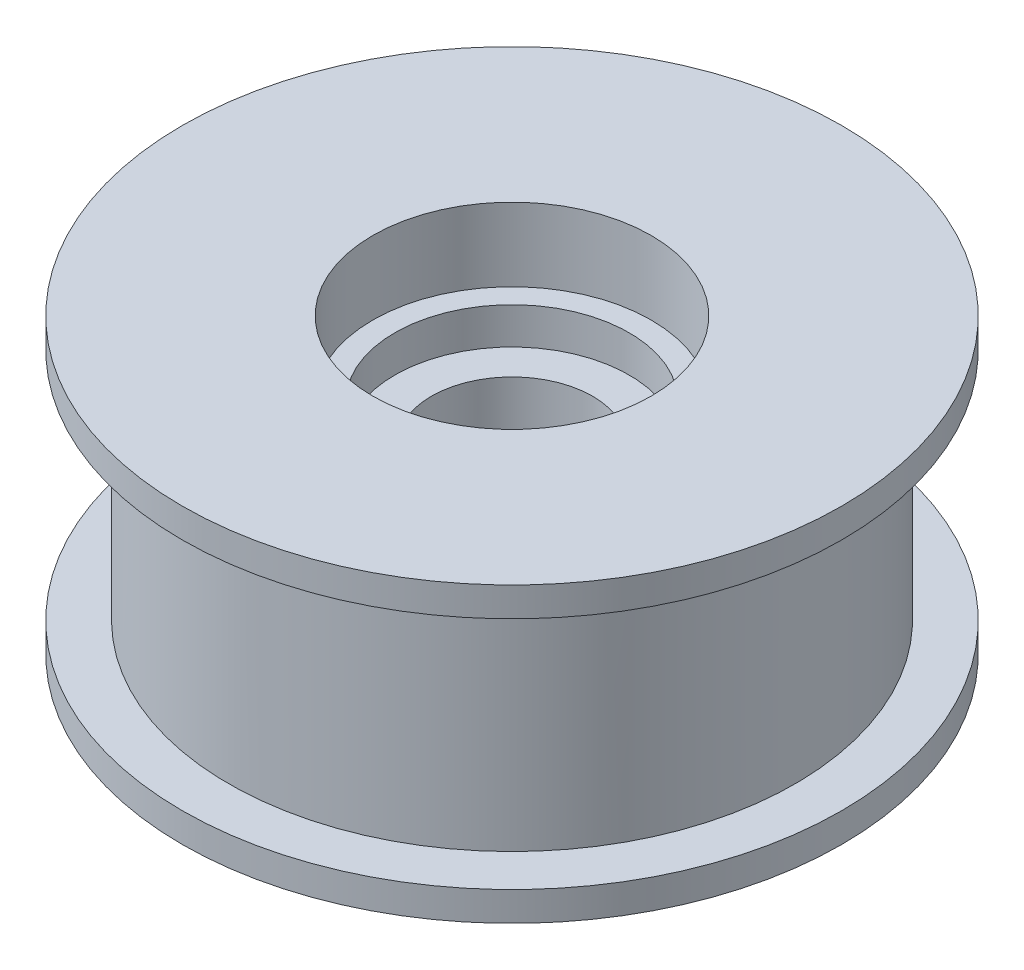
ISO-10303-21;
HEADER;
FILE_DESCRIPTION(('STEP AP214'),'2;1');
FILE_NAME('part.step','',(''),(''),'','','');
FILE_SCHEMA(('AUTOMOTIVE_DESIGN { 1 0 10303 214 1 1 1 1 }'));
ENDSEC;
DATA;
#1=APPLICATION_CONTEXT('core data for automotive mechanical design processes');
#2=APPLICATION_PROTOCOL_DEFINITION('international standard','automotive_design',2000,#1);
#3=PRODUCT_CONTEXT('',#1,'mechanical');
#4=PRODUCT('Part','Part','',(#3));
#5=PRODUCT_RELATED_PRODUCT_CATEGORY('part','',(#4));
#6=PRODUCT_DEFINITION_FORMATION('','',#4);
#7=PRODUCT_DEFINITION_CONTEXT('part definition',#1,'design');
#8=PRODUCT_DEFINITION('design','',#6,#7);
#9=PRODUCT_DEFINITION_SHAPE('','',#8);
#10=(LENGTH_UNIT() NAMED_UNIT(*) SI_UNIT(.MILLI.,.METRE.));
#11=(NAMED_UNIT(*) PLANE_ANGLE_UNIT() SI_UNIT($,.RADIAN.));
#12=(NAMED_UNIT(*) SI_UNIT($,.STERADIAN.) SOLID_ANGLE_UNIT());
#13=UNCERTAINTY_MEASURE_WITH_UNIT(LENGTH_MEASURE(1.E-05),#10,'distance_accuracy_value','');
#14=(GEOMETRIC_REPRESENTATION_CONTEXT(3) GLOBAL_UNCERTAINTY_ASSIGNED_CONTEXT((#13)) GLOBAL_UNIT_ASSIGNED_CONTEXT((#10,
#11,#12)) REPRESENTATION_CONTEXT('',''));
#15=CARTESIAN_POINT('',(0.,0.,0.));
#16=DIRECTION('',(0.,0.,1.));
#17=DIRECTION('',(1.,0.,0.));
#18=AXIS2_PLACEMENT_3D('',#15,#16,#17);
#19=CARTESIAN_POINT('',(0.,33.5563491861041,0.));
#20=DIRECTION('',(0.,-1.,0.));
#21=DIRECTION('',(0.,0.,-1.));
#22=AXIS2_PLACEMENT_3D('',#19,#20,#21);
#23=CYLINDRICAL_SURFACE('',#22,5.5);
#24=CARTESIAN_POINT('',(0.,-2.,0.));
#25=DIRECTION('',(0.,-1.,0.));
#26=DIRECTION('',(0.,0.,-1.));
#27=AXIS2_PLACEMENT_3D('',#24,#25,#26);
#28=CIRCLE('',#27,5.5);
#29=CARTESIAN_POINT('',(0.,-2.,-5.5));
#30=VERTEX_POINT('',#29);
#31=EDGE_CURVE('E110',#30,#30,#28,.T.);
#32=ORIENTED_EDGE('',*,*,#31,.T.);
#33=EDGE_LOOP('',(#32));
#34=FACE_BOUND('',#33,.T.);
#35=CARTESIAN_POINT('',(0.,10.5,0.));
#36=DIRECTION('',(0.,1.,0.));
#37=DIRECTION('',(0.,0.,1.));
#38=AXIS2_PLACEMENT_3D('',#35,#36,#37);
#39=CIRCLE('',#38,5.5);
#40=CARTESIAN_POINT('',(0.,10.5,5.5));
#41=VERTEX_POINT('',#40);
#42=EDGE_CURVE('E46',#41,#41,#39,.F.);
#43=ORIENTED_EDGE('',*,*,#42,.F.);
#44=EDGE_LOOP('',(#43));
#45=FACE_BOUND('',#44,.T.);
#46=ADVANCED_FACE('F42',(#34,#45),#23,.F.);
#47=CARTESIAN_POINT('',(0.,16.,0.));
#48=DIRECTION('',(0.,-1.,0.));
#49=DIRECTION('',(0.,0.,-1.));
#50=AXIS2_PLACEMENT_3D('',#47,#48,#49);
#51=CYLINDRICAL_SURFACE('',#50,19.325);
#52=CARTESIAN_POINT('',(0.,16.,0.));
#53=DIRECTION('',(0.,1.,0.));
#54=DIRECTION('',(0.,0.,1.));
#55=AXIS2_PLACEMENT_3D('',#52,#53,#54);
#56=CIRCLE('',#55,19.325);
#57=CARTESIAN_POINT('',(0.,16.,19.325));
#58=VERTEX_POINT('',#57);
#59=EDGE_CURVE('E11',#58,#58,#56,.T.);
#60=ORIENTED_EDGE('',*,*,#59,.F.);
#61=EDGE_LOOP('',(#60));
#62=FACE_BOUND('',#61,.T.);
#63=CARTESIAN_POINT('',(0.,0.,0.));
#64=DIRECTION('',(0.,-1.,0.));
#65=DIRECTION('',(0.,0.,-1.));
#66=AXIS2_PLACEMENT_3D('',#63,#64,#65);
#67=CIRCLE('',#66,19.325);
#68=CARTESIAN_POINT('',(0.,0.,-19.325));
#69=VERTEX_POINT('',#68);
#70=EDGE_CURVE('E119',#69,#69,#67,.T.);
#71=ORIENTED_EDGE('',*,*,#70,.F.);
#72=EDGE_LOOP('',(#71));
#73=FACE_BOUND('',#72,.T.);
#74=ADVANCED_FACE('F44',(#62,#73),#51,.T.);
#75=CARTESIAN_POINT('',(0.,16.,0.));
#76=DIRECTION('',(0.,1.,0.));
#77=DIRECTION('',(0.,0.,1.));
#78=AXIS2_PLACEMENT_3D('',#75,#76,#77);
#79=PLANE('',#78);
#80=CARTESIAN_POINT('',(0.,16.,0.));
#81=DIRECTION('',(0.,1.,0.));
#82=DIRECTION('',(0.,0.,1.));
#83=AXIS2_PLACEMENT_3D('',#80,#81,#82);
#84=CIRCLE('',#83,22.5);
#85=CARTESIAN_POINT('',(0.,16.,22.5));
#86=VERTEX_POINT('',#85);
#87=EDGE_CURVE('E125',#86,#86,#84,.T.);
#88=ORIENTED_EDGE('',*,*,#87,.F.);
#89=EDGE_LOOP('',(#88));
#90=FACE_BOUND('',#89,.T.);
#91=ORIENTED_EDGE('',*,*,#59,.T.);
#92=EDGE_LOOP('',(#91));
#93=FACE_BOUND('',#92,.T.);
#94=ADVANCED_FACE('F135',(#90,#93),#79,.F.);
#95=CARTESIAN_POINT('',(0.,18.,0.));
#96=DIRECTION('',(0.,1.,0.));
#97=DIRECTION('',(0.,0.,1.));
#98=AXIS2_PLACEMENT_3D('',#95,#96,#97);
#99=PLANE('',#98);
#100=CARTESIAN_POINT('',(0.,18.,0.));
#101=DIRECTION('',(0.,1.,0.));
#102=DIRECTION('',(0.,0.,1.));
#103=AXIS2_PLACEMENT_3D('',#100,#101,#102);
#104=CIRCLE('',#103,9.5);
#105=CARTESIAN_POINT('',(0.,18.,9.5));
#106=VERTEX_POINT('',#105);
#107=EDGE_CURVE('E215',#106,#106,#104,.T.);
#108=ORIENTED_EDGE('',*,*,#107,.F.);
#109=EDGE_LOOP('',(#108));
#110=FACE_BOUND('',#109,.T.);
#111=CARTESIAN_POINT('',(0.,18.,0.));
#112=DIRECTION('',(0.,1.,0.));
#113=DIRECTION('',(0.,0.,1.));
#114=AXIS2_PLACEMENT_3D('',#111,#112,#113);
#115=CIRCLE('',#114,22.5);
#116=CARTESIAN_POINT('',(0.,18.,22.5));
#117=VERTEX_POINT('',#116);
#118=EDGE_CURVE('E52',#117,#117,#115,.T.);
#119=ORIENTED_EDGE('',*,*,#118,.T.);
#120=EDGE_LOOP('',(#119));
#121=FACE_BOUND('',#120,.T.);
#122=ADVANCED_FACE('F138',(#110,#121),#99,.T.);
#123=CARTESIAN_POINT('',(0.,18.,0.));
#124=DIRECTION('',(0.,-1.,0.));
#125=DIRECTION('',(0.,0.,-1.));
#126=AXIS2_PLACEMENT_3D('',#123,#124,#125);
#127=CYLINDRICAL_SURFACE('',#126,22.5);
#128=ORIENTED_EDGE('',*,*,#118,.F.);
#129=EDGE_LOOP('',(#128));
#130=FACE_BOUND('',#129,.T.);
#131=ORIENTED_EDGE('',*,*,#87,.T.);
#132=EDGE_LOOP('',(#131));
#133=FACE_BOUND('',#132,.T.);
#134=ADVANCED_FACE('F133',(#130,#133),#127,.T.);
#135=CARTESIAN_POINT('',(0.,0.,0.));
#136=DIRECTION('',(0.,-1.,0.));
#137=DIRECTION('',(0.,0.,-1.));
#138=AXIS2_PLACEMENT_3D('',#135,#136,#137);
#139=PLANE('',#138);
#140=CARTESIAN_POINT('',(0.,0.,0.));
#141=DIRECTION('',(0.,-1.,0.));
#142=DIRECTION('',(0.,0.,-1.));
#143=AXIS2_PLACEMENT_3D('',#140,#141,#142);
#144=CIRCLE('',#143,22.5);
#145=CARTESIAN_POINT('',(0.,0.,-22.5));
#146=VERTEX_POINT('',#145);
#147=EDGE_CURVE('E114',#146,#146,#144,.T.);
#148=ORIENTED_EDGE('',*,*,#147,.F.);
#149=EDGE_LOOP('',(#148));
#150=FACE_BOUND('',#149,.T.);
#151=ORIENTED_EDGE('',*,*,#70,.T.);
#152=EDGE_LOOP('',(#151));
#153=FACE_BOUND('',#152,.T.);
#154=ADVANCED_FACE('F146',(#150,#153),#139,.F.);
#155=CARTESIAN_POINT('',(0.,-2.,0.));
#156=DIRECTION('',(0.,-1.,0.));
#157=DIRECTION('',(0.,0.,-1.));
#158=AXIS2_PLACEMENT_3D('',#155,#156,#157);
#159=PLANE('',#158);
#160=CARTESIAN_POINT('',(0.,-2.,8.));
#161=DIRECTION('',(0.,-1.,0.));
#162=DIRECTION('',(0.,0.,-1.));
#163=AXIS2_PLACEMENT_3D('',#160,#161,#162);
#164=CIRCLE('',#163,1.24999999999999);
#165=CARTESIAN_POINT('',(0.,-2.,6.75000000000001));
#166=VERTEX_POINT('',#165);
#167=EDGE_CURVE('E77',#166,#166,#164,.T.);
#168=ORIENTED_EDGE('',*,*,#167,.F.);
#169=EDGE_LOOP('',(#168));
#170=FACE_BOUND('',#169,.T.);
#171=CARTESIAN_POINT('',(8.,-2.,0.));
#172=DIRECTION('',(0.,-1.,0.));
#173=DIRECTION('',(0.,0.,-1.));
#174=AXIS2_PLACEMENT_3D('',#171,#172,#173);
#175=CIRCLE('',#174,1.24999999999999);
#176=CARTESIAN_POINT('',(8.,-2.,-1.24999999999999));
#177=VERTEX_POINT('',#176);
#178=EDGE_CURVE('E76',#177,#177,#175,.T.);
#179=ORIENTED_EDGE('',*,*,#178,.F.);
#180=EDGE_LOOP('',(#179));
#181=FACE_BOUND('',#180,.T.);
#182=CARTESIAN_POINT('',(0.,-2.,-8.));
#183=DIRECTION('',(0.,-1.,0.));
#184=DIRECTION('',(0.,0.,-1.));
#185=AXIS2_PLACEMENT_3D('',#182,#183,#184);
#186=CIRCLE('',#185,1.24999999999999);
#187=CARTESIAN_POINT('',(0.,-2.,-9.24999999999999));
#188=VERTEX_POINT('',#187);
#189=EDGE_CURVE('E94',#188,#188,#186,.T.);
#190=ORIENTED_EDGE('',*,*,#189,.F.);
#191=EDGE_LOOP('',(#190));
#192=FACE_BOUND('',#191,.T.);
#193=CARTESIAN_POINT('',(-8.,-2.,0.));
#194=DIRECTION('',(0.,-1.,0.));
#195=DIRECTION('',(0.,0.,-1.));
#196=AXIS2_PLACEMENT_3D('',#193,#194,#195);
#197=CIRCLE('',#196,1.24999999999999);
#198=CARTESIAN_POINT('',(-8.,-2.,-1.24999999999999));
#199=VERTEX_POINT('',#198);
#200=EDGE_CURVE('E102',#199,#199,#197,.T.);
#201=ORIENTED_EDGE('',*,*,#200,.F.);
#202=EDGE_LOOP('',(#201));
#203=FACE_BOUND('',#202,.T.);
#204=ORIENTED_EDGE('',*,*,#31,.F.);
#205=EDGE_LOOP('',(#204));
#206=FACE_BOUND('',#205,.T.);
#207=CARTESIAN_POINT('',(0.,-2.,0.));
#208=DIRECTION('',(0.,-1.,0.));
#209=DIRECTION('',(0.,0.,-1.));
#210=AXIS2_PLACEMENT_3D('',#207,#208,#209);
#211=CIRCLE('',#210,22.5);
#212=CARTESIAN_POINT('',(0.,-2.,-22.5));
#213=VERTEX_POINT('',#212);
#214=EDGE_CURVE('E115',#213,#213,#211,.T.);
#215=ORIENTED_EDGE('',*,*,#214,.T.);
#216=EDGE_LOOP('',(#215));
#217=FACE_BOUND('',#216,.T.);
#218=ADVANCED_FACE('F148',(#170,#181,#192,#203,#206,#217),#159,.T.);
#219=CARTESIAN_POINT('',(0.,-2.,0.));
#220=DIRECTION('',(0.,1.,0.));
#221=DIRECTION('',(0.,0.,1.));
#222=AXIS2_PLACEMENT_3D('',#219,#220,#221);
#223=CYLINDRICAL_SURFACE('',#222,22.5);
#224=ORIENTED_EDGE('',*,*,#214,.F.);
#225=EDGE_LOOP('',(#224));
#226=FACE_BOUND('',#225,.T.);
#227=ORIENTED_EDGE('',*,*,#147,.T.);
#228=EDGE_LOOP('',(#227));
#229=FACE_BOUND('',#228,.T.);
#230=ADVANCED_FACE('F155',(#226,#229),#223,.T.);
#231=CARTESIAN_POINT('',(-8.,6.50000000000001,0.));
#232=DIRECTION('',(0.,-1.,0.));
#233=DIRECTION('',(0.,0.,-1.));
#234=AXIS2_PLACEMENT_3D('',#231,#232,#233);
#235=CONICAL_SURFACE('',#234,1.24999999999999,1.02974425867665);
#236=CARTESIAN_POINT('',(-8.,7.25107577378445,0.));
#237=VERTEX_POINT('',#236);
#238=VERTEX_LOOP('',#237);
#239=FACE_BOUND('',#238,.T.);
#240=CARTESIAN_POINT('',(-8.,6.50000000000001,0.));
#241=DIRECTION('',(0.,-1.,0.));
#242=DIRECTION('',(0.,0.,-1.));
#243=AXIS2_PLACEMENT_3D('',#240,#241,#242);
#244=CIRCLE('',#243,1.24999999999999);
#245=CARTESIAN_POINT('',(-8.,6.50000000000001,-1.24999999999999));
#246=VERTEX_POINT('',#245);
#247=EDGE_CURVE('E106',#246,#246,#244,.T.);
#248=ORIENTED_EDGE('',*,*,#247,.T.);
#249=EDGE_LOOP('',(#248));
#250=FACE_BOUND('',#249,.T.);
#251=ADVANCED_FACE('F168',(#239,#250),#235,.F.);
#252=CARTESIAN_POINT('',(-8.,-2.,0.));
#253=DIRECTION('',(0.,-1.,0.));
#254=DIRECTION('',(0.,0.,-1.));
#255=AXIS2_PLACEMENT_3D('',#252,#253,#254);
#256=CYLINDRICAL_SURFACE('',#255,1.24999999999999);
#257=ORIENTED_EDGE('',*,*,#247,.F.);
#258=EDGE_LOOP('',(#257));
#259=FACE_BOUND('',#258,.T.);
#260=ORIENTED_EDGE('',*,*,#200,.T.);
#261=EDGE_LOOP('',(#260));
#262=FACE_BOUND('',#261,.T.);
#263=ADVANCED_FACE('F171',(#259,#262),#256,.F.);
#264=CARTESIAN_POINT('',(0.,6.50000000000001,-8.));
#265=DIRECTION('',(0.,-1.,0.));
#266=DIRECTION('',(0.,0.,-1.));
#267=AXIS2_PLACEMENT_3D('',#264,#265,#266);
#268=CONICAL_SURFACE('',#267,1.24999999999999,1.02974425867665);
#269=CARTESIAN_POINT('',(0.,7.25107577378445,-8.));
#270=VERTEX_POINT('',#269);
#271=VERTEX_LOOP('',#270);
#272=FACE_BOUND('',#271,.T.);
#273=CARTESIAN_POINT('',(0.,6.50000000000001,-8.));
#274=DIRECTION('',(0.,-1.,0.));
#275=DIRECTION('',(0.,0.,-1.));
#276=AXIS2_PLACEMENT_3D('',#273,#274,#275);
#277=CIRCLE('',#276,1.24999999999999);
#278=CARTESIAN_POINT('',(0.,6.50000000000001,-9.24999999999999));
#279=VERTEX_POINT('',#278);
#280=EDGE_CURVE('E98',#279,#279,#277,.T.);
#281=ORIENTED_EDGE('',*,*,#280,.T.);
#282=EDGE_LOOP('',(#281));
#283=FACE_BOUND('',#282,.T.);
#284=ADVANCED_FACE('F174',(#272,#283),#268,.F.);
#285=CARTESIAN_POINT('',(0.,-2.,-8.));
#286=DIRECTION('',(0.,-1.,0.));
#287=DIRECTION('',(0.,0.,-1.));
#288=AXIS2_PLACEMENT_3D('',#285,#286,#287);
#289=CYLINDRICAL_SURFACE('',#288,1.24999999999999);
#290=ORIENTED_EDGE('',*,*,#280,.F.);
#291=EDGE_LOOP('',(#290));
#292=FACE_BOUND('',#291,.T.);
#293=ORIENTED_EDGE('',*,*,#189,.T.);
#294=EDGE_LOOP('',(#293));
#295=FACE_BOUND('',#294,.T.);
#296=ADVANCED_FACE('F178',(#292,#295),#289,.F.);
#297=CARTESIAN_POINT('',(8.,6.50000000000001,0.));
#298=DIRECTION('',(0.,-1.,0.));
#299=DIRECTION('',(0.,0.,-1.));
#300=AXIS2_PLACEMENT_3D('',#297,#298,#299);
#301=CONICAL_SURFACE('',#300,1.24999999999999,1.02974425867665);
#302=CARTESIAN_POINT('',(8.,7.25107577378445,0.));
#303=VERTEX_POINT('',#302);
#304=VERTEX_LOOP('',#303);
#305=FACE_BOUND('',#304,.T.);
#306=CARTESIAN_POINT('',(8.,6.50000000000001,0.));
#307=DIRECTION('',(0.,-1.,0.));
#308=DIRECTION('',(0.,0.,-1.));
#309=AXIS2_PLACEMENT_3D('',#306,#307,#308);
#310=CIRCLE('',#309,1.24999999999999);
#311=CARTESIAN_POINT('',(8.,6.50000000000001,-1.24999999999999));
#312=VERTEX_POINT('',#311);
#313=EDGE_CURVE('E83',#312,#312,#310,.T.);
#314=ORIENTED_EDGE('',*,*,#313,.T.);
#315=EDGE_LOOP('',(#314));
#316=FACE_BOUND('',#315,.T.);
#317=ADVANCED_FACE('F181',(#305,#316),#301,.F.);
#318=CARTESIAN_POINT('',(8.,-2.,0.));
#319=DIRECTION('',(0.,-1.,0.));
#320=DIRECTION('',(0.,0.,-1.));
#321=AXIS2_PLACEMENT_3D('',#318,#319,#320);
#322=CYLINDRICAL_SURFACE('',#321,1.24999999999999);
#323=ORIENTED_EDGE('',*,*,#313,.F.);
#324=EDGE_LOOP('',(#323));
#325=FACE_BOUND('',#324,.T.);
#326=ORIENTED_EDGE('',*,*,#178,.T.);
#327=EDGE_LOOP('',(#326));
#328=FACE_BOUND('',#327,.T.);
#329=ADVANCED_FACE('F69',(#325,#328),#322,.F.);
#330=CARTESIAN_POINT('',(0.,6.50000000000001,8.));
#331=DIRECTION('',(0.,-1.,0.));
#332=DIRECTION('',(0.,0.,-1.));
#333=AXIS2_PLACEMENT_3D('',#330,#331,#332);
#334=CONICAL_SURFACE('',#333,1.24999999999999,1.02974425867665);
#335=CARTESIAN_POINT('',(0.,7.25107577378445,8.));
#336=VERTEX_POINT('',#335);
#337=VERTEX_LOOP('',#336);
#338=FACE_BOUND('',#337,.T.);
#339=CARTESIAN_POINT('',(0.,6.50000000000001,8.));
#340=DIRECTION('',(0.,-1.,0.));
#341=DIRECTION('',(0.,0.,-1.));
#342=AXIS2_PLACEMENT_3D('',#339,#340,#341);
#343=CIRCLE('',#342,1.24999999999999);
#344=CARTESIAN_POINT('',(0.,6.50000000000001,6.75000000000001));
#345=VERTEX_POINT('',#344);
#346=EDGE_CURVE('E73',#345,#345,#343,.T.);
#347=ORIENTED_EDGE('',*,*,#346,.T.);
#348=EDGE_LOOP('',(#347));
#349=FACE_BOUND('',#348,.T.);
#350=ADVANCED_FACE('F65',(#338,#349),#334,.F.);
#351=CARTESIAN_POINT('',(0.,-2.,8.));
#352=DIRECTION('',(0.,-1.,0.));
#353=DIRECTION('',(0.,0.,-1.));
#354=AXIS2_PLACEMENT_3D('',#351,#352,#353);
#355=CYLINDRICAL_SURFACE('',#354,1.24999999999999);
#356=ORIENTED_EDGE('',*,*,#346,.F.);
#357=EDGE_LOOP('',(#356));
#358=FACE_BOUND('',#357,.T.);
#359=ORIENTED_EDGE('',*,*,#167,.T.);
#360=EDGE_LOOP('',(#359));
#361=FACE_BOUND('',#360,.T.);
#362=ADVANCED_FACE('F68',(#358,#361),#355,.F.);
#363=CARTESIAN_POINT('',(0.,13.,0.));
#364=DIRECTION('',(0.,1.,0.));
#365=DIRECTION('',(0.,0.,1.));
#366=AXIS2_PLACEMENT_3D('',#363,#364,#365);
#367=PLANE('',#366);
#368=CARTESIAN_POINT('',(0.,13.,0.));
#369=DIRECTION('',(0.,1.,0.));
#370=DIRECTION('',(0.,0.,1.));
#371=AXIS2_PLACEMENT_3D('',#368,#369,#370);
#372=CIRCLE('',#371,8.);
#373=CARTESIAN_POINT('',(0.,13.,8.));
#374=VERTEX_POINT('',#373);
#375=EDGE_CURVE('E218',#374,#374,#372,.T.);
#376=ORIENTED_EDGE('',*,*,#375,.F.);
#377=EDGE_LOOP('',(#376));
#378=FACE_BOUND('',#377,.T.);
#379=CARTESIAN_POINT('',(0.,13.,0.));
#380=DIRECTION('',(0.,1.,0.));
#381=DIRECTION('',(0.,0.,1.));
#382=AXIS2_PLACEMENT_3D('',#379,#380,#381);
#383=CIRCLE('',#382,9.5);
#384=CARTESIAN_POINT('',(0.,13.,9.5));
#385=VERTEX_POINT('',#384);
#386=EDGE_CURVE('E87',#385,#385,#383,.T.);
#387=ORIENTED_EDGE('',*,*,#386,.T.);
#388=EDGE_LOOP('',(#387));
#389=FACE_BOUND('',#388,.T.);
#390=ADVANCED_FACE('F191',(#378,#389),#367,.T.);
#391=CARTESIAN_POINT('',(0.,13.,0.));
#392=DIRECTION('',(0.,1.,0.));
#393=DIRECTION('',(0.,0.,1.));
#394=AXIS2_PLACEMENT_3D('',#391,#392,#393);
#395=CYLINDRICAL_SURFACE('',#394,9.5);
#396=ORIENTED_EDGE('',*,*,#386,.F.);
#397=EDGE_LOOP('',(#396));
#398=FACE_BOUND('',#397,.T.);
#399=ORIENTED_EDGE('',*,*,#107,.T.);
#400=EDGE_LOOP('',(#399));
#401=FACE_BOUND('',#400,.T.);
#402=ADVANCED_FACE('F192',(#398,#401),#395,.F.);
#403=CARTESIAN_POINT('',(0.,10.5,0.));
#404=DIRECTION('',(0.,1.,0.));
#405=DIRECTION('',(0.,0.,1.));
#406=AXIS2_PLACEMENT_3D('',#403,#404,#405);
#407=PLANE('',#406);
#408=CARTESIAN_POINT('',(0.,10.5,0.));
#409=DIRECTION('',(0.,1.,0.));
#410=DIRECTION('',(0.,0.,1.));
#411=AXIS2_PLACEMENT_3D('',#408,#409,#410);
#412=CIRCLE('',#411,8.);
#413=CARTESIAN_POINT('',(0.,10.5,8.));
#414=VERTEX_POINT('',#413);
#415=EDGE_CURVE('E211',#414,#414,#412,.T.);
#416=ORIENTED_EDGE('',*,*,#415,.T.);
#417=EDGE_LOOP('',(#416));
#418=FACE_BOUND('',#417,.T.);
#419=ORIENTED_EDGE('',*,*,#42,.T.);
#420=EDGE_LOOP('',(#419));
#421=FACE_BOUND('',#420,.T.);
#422=ADVANCED_FACE('F195',(#418,#421),#407,.T.);
#423=CARTESIAN_POINT('',(0.,10.5,0.));
#424=DIRECTION('',(0.,1.,0.));
#425=DIRECTION('',(0.,0.,1.));
#426=AXIS2_PLACEMENT_3D('',#423,#424,#425);
#427=CYLINDRICAL_SURFACE('',#426,8.);
#428=ORIENTED_EDGE('',*,*,#415,.F.);
#429=EDGE_LOOP('',(#428));
#430=FACE_BOUND('',#429,.T.);
#431=ORIENTED_EDGE('',*,*,#375,.T.);
#432=EDGE_LOOP('',(#431));
#433=FACE_BOUND('',#432,.T.);
#434=ADVANCED_FACE('F200',(#430,#433),#427,.F.);
#435=CLOSED_SHELL('',(#46,#74,#94,#122,#134,#154,#218,#230,#251,#263,#284,#296,#317,#329,#350,
#362,#390,#402,#422,#434));
#436=MANIFOLD_SOLID_BREP('B2',#435);
#437=ADVANCED_BREP_SHAPE_REPRESENTATION('',(#18,#436),#14);
#438=SHAPE_DEFINITION_REPRESENTATION(#9,#437);
ENDSEC;
END-ISO-10303-21;
